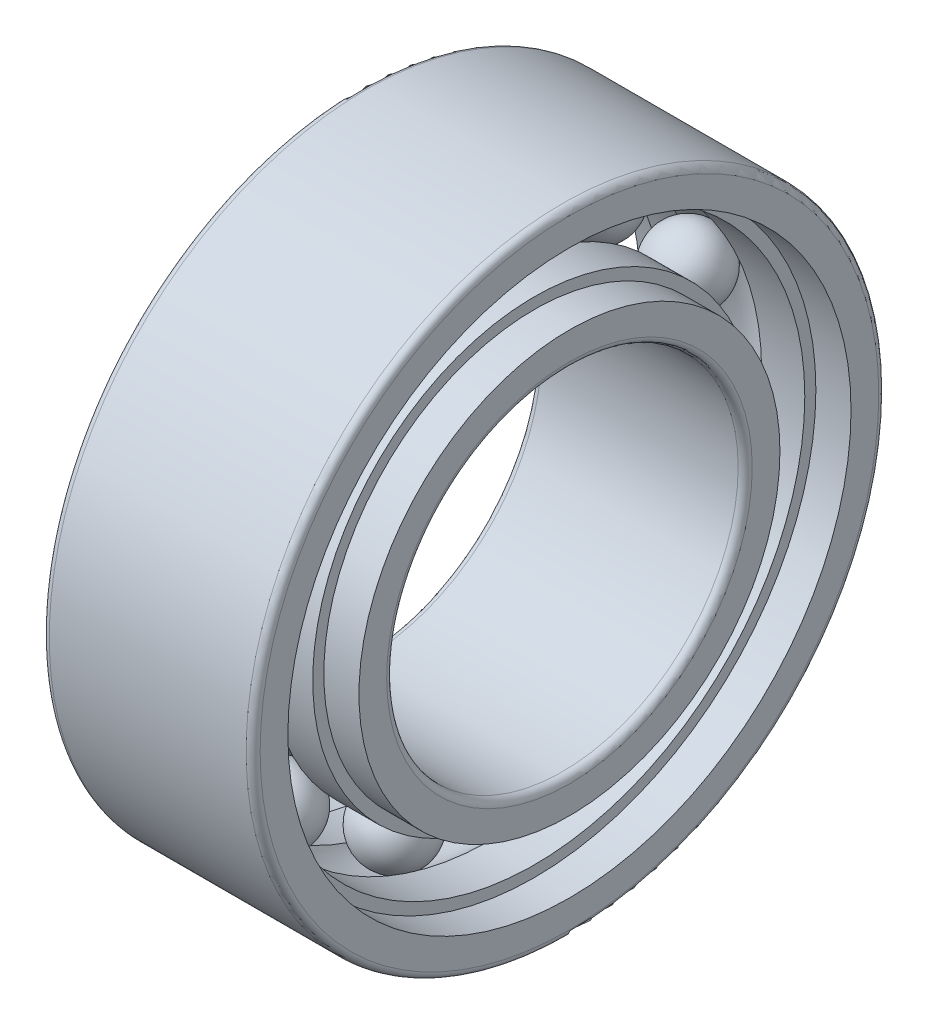
ISO-10303-21;
HEADER;
FILE_DESCRIPTION(('STEP AP214'),'2;1');
FILE_NAME('part.step','',(''),(''),'','','');
FILE_SCHEMA(('AUTOMOTIVE_DESIGN { 1 0 10303 214 1 1 1 1 }'));
ENDSEC;
DATA;
#1=APPLICATION_CONTEXT('core data for automotive mechanical design processes');
#2=APPLICATION_PROTOCOL_DEFINITION('international standard','automotive_design',2000,#1);
#3=PRODUCT_CONTEXT('',#1,'mechanical');
#4=PRODUCT('Part','Part','',(#3));
#5=PRODUCT_RELATED_PRODUCT_CATEGORY('part','',(#4));
#6=PRODUCT_DEFINITION_FORMATION('','',#4);
#7=PRODUCT_DEFINITION_CONTEXT('part definition',#1,'design');
#8=PRODUCT_DEFINITION('design','',#6,#7);
#9=PRODUCT_DEFINITION_SHAPE('','',#8);
#10=(LENGTH_UNIT() NAMED_UNIT(*) SI_UNIT(.MILLI.,.METRE.));
#11=(NAMED_UNIT(*) PLANE_ANGLE_UNIT() SI_UNIT($,.RADIAN.));
#12=(NAMED_UNIT(*) SI_UNIT($,.STERADIAN.) SOLID_ANGLE_UNIT());
#13=UNCERTAINTY_MEASURE_WITH_UNIT(LENGTH_MEASURE(1.E-05),#10,'distance_accuracy_value','');
#14=(GEOMETRIC_REPRESENTATION_CONTEXT(3) GLOBAL_UNCERTAINTY_ASSIGNED_CONTEXT((#13)) GLOBAL_UNIT_ASSIGNED_CONTEXT((#10,
#11,#12)) REPRESENTATION_CONTEXT('',''));
#15=CARTESIAN_POINT('',(0.,0.,0.));
#16=DIRECTION('',(0.,0.,1.));
#17=DIRECTION('',(1.,0.,0.));
#18=AXIS2_PLACEMENT_3D('',#15,#16,#17);
#19=CARTESIAN_POINT('',(1.5,0.,0.));
#20=DIRECTION('',(1.,0.,0.));
#21=DIRECTION('',(0.,0.,-1.));
#22=AXIS2_PLACEMENT_3D('',#19,#20,#21);
#23=TOROIDAL_SURFACE('',#22,3.5,0.52);
#24=CARTESIAN_POINT('',(1.11361159437685,0.,0.));
#25=DIRECTION('',(1.,0.,0.));
#26=DIRECTION('',(0.,0.,-1.));
#27=AXIS2_PLACEMENT_3D('',#24,#25,#26);
#28=CIRCLE('',#27,3.152);
#29=CARTESIAN_POINT('',(1.11361159437685,0.,-3.152));
#30=VERTEX_POINT('',#29);
#31=EDGE_CURVE('P0_E141',#30,#30,#28,.F.);
#32=ORIENTED_EDGE('',*,*,#31,.F.);
#33=EDGE_LOOP('',(#32));
#34=FACE_BOUND('',#33,.T.);
#35=CARTESIAN_POINT('',(1.88638840562315,0.,0.));
#36=DIRECTION('',(1.,0.,0.));
#37=DIRECTION('',(0.,0.,-1.));
#38=AXIS2_PLACEMENT_3D('',#35,#36,#37);
#39=CIRCLE('',#38,3.152);
#40=CARTESIAN_POINT('',(1.88638840562315,0.,-3.152));
#41=VERTEX_POINT('',#40);
#42=EDGE_CURVE('P0_E145',#41,#41,#39,.T.);
#43=ORIENTED_EDGE('',*,*,#42,.F.);
#44=EDGE_LOOP('',(#43));
#45=FACE_BOUND('',#44,.T.);
#46=ADVANCED_FACE('P0_F14',(#34,#45),#23,.F.);
#47=CARTESIAN_POINT('',(2.19319420281158,0.,0.));
#48=DIRECTION('',(1.,0.,0.));
#49=DIRECTION('',(0.,0.,-1.));
#50=AXIS2_PLACEMENT_3D('',#47,#48,#49);
#51=CYLINDRICAL_SURFACE('',#50,3.152);
#52=ORIENTED_EDGE('',*,*,#42,.T.);
#53=EDGE_LOOP('',(#52));
#54=FACE_BOUND('',#53,.T.);
#55=CARTESIAN_POINT('',(2.50000000000001,0.,0.));
#56=DIRECTION('',(1.,0.,0.));
#57=DIRECTION('',(0.,0.,-1.));
#58=AXIS2_PLACEMENT_3D('',#55,#56,#57);
#59=CIRCLE('',#58,3.152);
#60=CARTESIAN_POINT('',(2.50000000000001,0.,-3.152));
#61=VERTEX_POINT('',#60);
#62=EDGE_CURVE('P0_E18',#61,#61,#59,.T.);
#63=ORIENTED_EDGE('',*,*,#62,.F.);
#64=EDGE_LOOP('',(#63));
#65=FACE_BOUND('',#64,.T.);
#66=ADVANCED_FACE('P0_F100',(#54,#65),#51,.T.);
#67=CARTESIAN_POINT('',(0.806805797188427,0.,0.));
#68=DIRECTION('',(1.,0.,0.));
#69=DIRECTION('',(0.,0.,-1.));
#70=AXIS2_PLACEMENT_3D('',#67,#68,#69);
#71=CYLINDRICAL_SURFACE('',#70,3.152);
#72=CARTESIAN_POINT('',(0.500000000000003,0.,0.));
#73=DIRECTION('',(1.,0.,0.));
#74=DIRECTION('',(0.,0.,-1.));
#75=AXIS2_PLACEMENT_3D('',#72,#73,#74);
#76=CIRCLE('',#75,3.152);
#77=CARTESIAN_POINT('',(0.500000000000003,0.,-3.152));
#78=VERTEX_POINT('',#77);
#79=EDGE_CURVE('P0_E136',#78,#78,#76,.F.);
#80=ORIENTED_EDGE('',*,*,#79,.F.);
#81=EDGE_LOOP('',(#80));
#82=FACE_BOUND('',#81,.T.);
#83=ORIENTED_EDGE('',*,*,#31,.T.);
#84=EDGE_LOOP('',(#83));
#85=FACE_BOUND('',#84,.T.);
#86=ADVANCED_FACE('P0_F97',(#82,#85),#71,.T.);
#87=CARTESIAN_POINT('',(2.50000000000001,3.0732,0.));
#88=DIRECTION('',(1.,0.,0.));
#89=DIRECTION('',(0.,0.,-1.));
#90=AXIS2_PLACEMENT_3D('',#87,#88,#89);
#91=PLANE('',#90);
#92=CARTESIAN_POINT('',(2.50000000000001,0.,0.));
#93=DIRECTION('',(1.,0.,0.));
#94=DIRECTION('',(0.,0.,-1.));
#95=AXIS2_PLACEMENT_3D('',#92,#93,#94);
#96=CIRCLE('',#95,2.9944);
#97=CARTESIAN_POINT('',(2.50000000000001,0.,-2.9944));
#98=VERTEX_POINT('',#97);
#99=EDGE_CURVE('P0_E134',#98,#98,#96,.T.);
#100=ORIENTED_EDGE('',*,*,#99,.F.);
#101=EDGE_LOOP('',(#100));
#102=FACE_BOUND('',#101,.T.);
#103=ORIENTED_EDGE('',*,*,#62,.T.);
#104=EDGE_LOOP('',(#103));
#105=FACE_BOUND('',#104,.T.);
#106=ADVANCED_FACE('P0_F93',(#102,#105),#91,.T.);
#107=CARTESIAN_POINT('',(0.500000000000003,3.0732,0.));
#108=DIRECTION('',(-1.,0.,0.));
#109=DIRECTION('',(0.,0.,1.));
#110=AXIS2_PLACEMENT_3D('',#107,#108,#109);
#111=PLANE('',#110);
#112=CARTESIAN_POINT('',(0.500000000000003,0.,0.));
#113=DIRECTION('',(1.,0.,0.));
#114=DIRECTION('',(0.,0.,-1.));
#115=AXIS2_PLACEMENT_3D('',#112,#113,#114);
#116=CIRCLE('',#115,2.9944);
#117=CARTESIAN_POINT('',(0.500000000000003,0.,-2.9944));
#118=VERTEX_POINT('',#117);
#119=EDGE_CURVE('P0_E127',#118,#118,#116,.F.);
#120=ORIENTED_EDGE('',*,*,#119,.F.);
#121=EDGE_LOOP('',(#120));
#122=FACE_BOUND('',#121,.T.);
#123=ORIENTED_EDGE('',*,*,#79,.T.);
#124=EDGE_LOOP('',(#123));
#125=FACE_BOUND('',#124,.T.);
#126=ADVANCED_FACE('P0_F89',(#122,#125),#111,.T.);
#127=CARTESIAN_POINT('',(2.75000000000001,0.,0.));
#128=DIRECTION('',(1.,0.,0.));
#129=DIRECTION('',(0.,0.,-1.));
#130=AXIS2_PLACEMENT_3D('',#127,#128,#129);
#131=CYLINDRICAL_SURFACE('',#130,2.9944);
#132=ORIENTED_EDGE('',*,*,#99,.T.);
#133=EDGE_LOOP('',(#132));
#134=FACE_BOUND('',#133,.T.);
#135=CARTESIAN_POINT('',(3.00000000000001,0.,0.));
#136=DIRECTION('',(1.,0.,0.));
#137=DIRECTION('',(0.,0.,-1.));
#138=AXIS2_PLACEMENT_3D('',#135,#136,#137);
#139=CIRCLE('',#138,2.9944);
#140=CARTESIAN_POINT('',(3.00000000000001,0.,-2.9944));
#141=VERTEX_POINT('',#140);
#142=EDGE_CURVE('P0_E122',#141,#141,#139,.T.);
#143=ORIENTED_EDGE('',*,*,#142,.F.);
#144=EDGE_LOOP('',(#143));
#145=FACE_BOUND('',#144,.T.);
#146=ADVANCED_FACE('P0_F85',(#134,#145),#131,.T.);
#147=CARTESIAN_POINT('',(0.250000000000001,0.,0.));
#148=DIRECTION('',(1.,0.,0.));
#149=DIRECTION('',(0.,0.,-1.));
#150=AXIS2_PLACEMENT_3D('',#147,#148,#149);
#151=CYLINDRICAL_SURFACE('',#150,2.9944);
#152=CARTESIAN_POINT('',(0.,0.,0.));
#153=DIRECTION('',(1.,0.,0.));
#154=DIRECTION('',(0.,0.,-1.));
#155=AXIS2_PLACEMENT_3D('',#152,#153,#154);
#156=CIRCLE('',#155,2.9944);
#157=CARTESIAN_POINT('',(0.,0.,-2.9944));
#158=VERTEX_POINT('',#157);
#159=EDGE_CURVE('P0_E120',#158,#158,#156,.F.);
#160=ORIENTED_EDGE('',*,*,#159,.F.);
#161=EDGE_LOOP('',(#160));
#162=FACE_BOUND('',#161,.T.);
#163=ORIENTED_EDGE('',*,*,#119,.T.);
#164=EDGE_LOOP('',(#163));
#165=FACE_BOUND('',#164,.T.);
#166=ADVANCED_FACE('P0_F81',(#162,#165),#151,.T.);
#167=CARTESIAN_POINT('',(3.00000000000001,2.7472,0.));
#168=DIRECTION('',(1.,0.,0.));
#169=DIRECTION('',(0.,0.,-1.));
#170=AXIS2_PLACEMENT_3D('',#167,#168,#169);
#171=PLANE('',#170);
#172=CARTESIAN_POINT('',(3.00000000000001,0.,0.));
#173=DIRECTION('',(1.,0.,0.));
#174=DIRECTION('',(0.,1.,0.));
#175=AXIS2_PLACEMENT_3D('',#172,#173,#174);
#176=CIRCLE('',#175,2.6);
#177=CARTESIAN_POINT('',(3.00000000000001,2.6,0.));
#178=VERTEX_POINT('',#177);
#179=EDGE_CURVE('P0_E65',#178,#178,#176,.T.);
#180=ORIENTED_EDGE('',*,*,#179,.F.);
#181=EDGE_LOOP('',(#180));
#182=FACE_BOUND('',#181,.T.);
#183=ORIENTED_EDGE('',*,*,#142,.T.);
#184=EDGE_LOOP('',(#183));
#185=FACE_BOUND('',#184,.T.);
#186=ADVANCED_FACE('P0_F71',(#182,#185),#171,.T.);
#187=CARTESIAN_POINT('',(0.,2.7472,0.));
#188=DIRECTION('',(-1.,0.,0.));
#189=DIRECTION('',(0.,0.,1.));
#190=AXIS2_PLACEMENT_3D('',#187,#188,#189);
#191=PLANE('',#190);
#192=CARTESIAN_POINT('',(0.,0.,0.));
#193=DIRECTION('',(-1.,0.,0.));
#194=DIRECTION('',(0.,1.,0.));
#195=AXIS2_PLACEMENT_3D('',#192,#193,#194);
#196=CIRCLE('',#195,2.6);
#197=CARTESIAN_POINT('',(0.,2.6,0.));
#198=VERTEX_POINT('',#197);
#199=EDGE_CURVE('P0_E27',#198,#198,#196,.T.);
#200=ORIENTED_EDGE('',*,*,#199,.F.);
#201=EDGE_LOOP('',(#200));
#202=FACE_BOUND('',#201,.T.);
#203=ORIENTED_EDGE('',*,*,#159,.T.);
#204=EDGE_LOOP('',(#203));
#205=FACE_BOUND('',#204,.T.);
#206=ADVANCED_FACE('P0_F80',(#202,#205),#191,.T.);
#207=CARTESIAN_POINT('',(2.90000000000001,0.,0.));
#208=DIRECTION('',(1.,0.,0.));
#209=DIRECTION('',(0.,0.,-1.));
#210=AXIS2_PLACEMENT_3D('',#207,#208,#209);
#211=TOROIDAL_SURFACE('',#210,2.6,0.1);
#212=CARTESIAN_POINT('',(2.90000000000001,0.,0.));
#213=DIRECTION('',(1.,0.,0.));
#214=DIRECTION('',(0.,0.,-1.));
#215=AXIS2_PLACEMENT_3D('',#212,#213,#214);
#216=CIRCLE('',#215,2.5);
#217=CARTESIAN_POINT('',(2.90000000000001,0.,-2.5));
#218=VERTEX_POINT('',#217);
#219=EDGE_CURVE('P0_E22',#218,#218,#216,.F.);
#220=ORIENTED_EDGE('',*,*,#219,.T.);
#221=EDGE_LOOP('',(#220));
#222=FACE_BOUND('',#221,.T.);
#223=ORIENTED_EDGE('',*,*,#179,.T.);
#224=EDGE_LOOP('',(#223));
#225=FACE_BOUND('',#224,.T.);
#226=ADVANCED_FACE('P0_F45',(#222,#225),#211,.T.);
#227=CARTESIAN_POINT('',(0.1,0.,0.));
#228=DIRECTION('',(1.,0.,0.));
#229=DIRECTION('',(0.,0.,-1.));
#230=AXIS2_PLACEMENT_3D('',#227,#228,#229);
#231=TOROIDAL_SURFACE('',#230,2.6,0.1);
#232=ORIENTED_EDGE('',*,*,#199,.T.);
#233=EDGE_LOOP('',(#232));
#234=FACE_BOUND('',#233,.T.);
#235=CARTESIAN_POINT('',(0.1,0.,0.));
#236=DIRECTION('',(1.,0.,0.));
#237=DIRECTION('',(0.,0.,-1.));
#238=AXIS2_PLACEMENT_3D('',#235,#236,#237);
#239=CIRCLE('',#238,2.5);
#240=CARTESIAN_POINT('',(0.1,0.,-2.5));
#241=VERTEX_POINT('',#240);
#242=EDGE_CURVE('P0_E10',#241,#241,#239,.T.);
#243=ORIENTED_EDGE('',*,*,#242,.T.);
#244=EDGE_LOOP('',(#243));
#245=FACE_BOUND('',#244,.T.);
#246=ADVANCED_FACE('P0_F39',(#234,#245),#231,.T.);
#247=CARTESIAN_POINT('',(1.5,0.,0.));
#248=DIRECTION('',(1.,0.,0.));
#249=DIRECTION('',(0.,0.,-1.));
#250=AXIS2_PLACEMENT_3D('',#247,#248,#249);
#251=CYLINDRICAL_SURFACE('',#250,2.5);
#252=ORIENTED_EDGE('',*,*,#242,.F.);
#253=EDGE_LOOP('',(#252));
#254=FACE_BOUND('',#253,.T.);
#255=ORIENTED_EDGE('',*,*,#219,.F.);
#256=EDGE_LOOP('',(#255));
#257=FACE_BOUND('',#256,.T.);
#258=ADVANCED_FACE('P0_F44',(#254,#257),#251,.F.);
#259=CLOSED_SHELL('',(#46,#66,#86,#106,#126,#146,#166,#186,#206,#226,#246,#258));
#260=MANIFOLD_SOLID_BREP('P0_B1',#259);
#261=CARTESIAN_POINT('',(1.5,-3.35822540765074,-0.986063948945003));
#262=DIRECTION('',(1.,0.,0.));
#263=DIRECTION('',(0.,-0.959492973614497,-0.28173255684143));
#264=AXIS2_PLACEMENT_3D('',#261,#262,#263);
#265=SPHERICAL_SURFACE('',#264,0.52);
#266=CARTESIAN_POINT('',(0.98,-3.35822540765074,-0.986063948945003));
#267=VERTEX_POINT('',#266);
#268=VERTEX_LOOP('',#267);
#269=FACE_BOUND('',#268,.T.);
#270=CARTESIAN_POINT('',(2.02,-3.35822540765074,-0.986063948945003));
#271=VERTEX_POINT('',#270);
#272=VERTEX_LOOP('',#271);
#273=FACE_BOUND('',#272,.T.);
#274=ADVANCED_FACE('P1_F15',(#269,#273),#265,.T.);
#275=CLOSED_SHELL('',(#274));
#276=MANIFOLD_SOLID_BREP('P1_B1',#275);
#277=CARTESIAN_POINT('',(1.5,-2.2920125688085,-2.6451235102399));
#278=DIRECTION('',(1.,0.,0.));
#279=DIRECTION('',(0.,-0.654860733945285,-0.755749574354258));
#280=AXIS2_PLACEMENT_3D('',#277,#278,#279);
#281=SPHERICAL_SURFACE('',#280,0.52);
#282=CARTESIAN_POINT('',(0.98,-2.2920125688085,-2.6451235102399));
#283=VERTEX_POINT('',#282);
#284=VERTEX_LOOP('',#283);
#285=FACE_BOUND('',#284,.T.);
#286=CARTESIAN_POINT('',(2.02,-2.2920125688085,-2.6451235102399));
#287=VERTEX_POINT('',#286);
#288=VERTEX_LOOP('',#287);
#289=FACE_BOUND('',#288,.T.);
#290=ADVANCED_FACE('P2_F15',(#285,#289),#281,.T.);
#291=CLOSED_SHELL('',(#290));
#292=MANIFOLD_SOLID_BREP('P2_B1',#291);
#293=CARTESIAN_POINT('',(1.5,3.5,0.));
#294=DIRECTION('',(1.,0.,0.));
#295=DIRECTION('',(0.,1.,0.));
#296=AXIS2_PLACEMENT_3D('',#293,#294,#295);
#297=SPHERICAL_SURFACE('',#296,0.52);
#298=CARTESIAN_POINT('',(0.98,3.5,0.));
#299=VERTEX_POINT('',#298);
#300=VERTEX_LOOP('',#299);
#301=FACE_BOUND('',#300,.T.);
#302=CARTESIAN_POINT('',(2.02,3.5,0.));
#303=VERTEX_POINT('',#302);
#304=VERTEX_LOOP('',#303);
#305=FACE_BOUND('',#304,.T.);
#306=ADVANCED_FACE('P3_F15',(#301,#305),#297,.T.);
#307=CLOSED_SHELL('',(#306));
#308=MANIFOLD_SOLID_BREP('P3_B1',#307);
#309=CARTESIAN_POINT('',(1.5,0.,0.));
#310=DIRECTION('',(1.,0.,0.));
#311=DIRECTION('',(0.,0.,-1.));
#312=AXIS2_PLACEMENT_3D('',#309,#310,#311);
#313=TOROIDAL_SURFACE('',#312,3.5,0.52);
#314=CARTESIAN_POINT('',(1.11361159437685,0.,0.));
#315=DIRECTION('',(1.,0.,0.));
#316=DIRECTION('',(0.,0.,-1.));
#317=AXIS2_PLACEMENT_3D('',#314,#315,#316);
#318=CIRCLE('',#317,3.848);
#319=CARTESIAN_POINT('',(1.11361159437685,0.,-3.848));
#320=VERTEX_POINT('',#319);
#321=EDGE_CURVE('P4_E143',#320,#320,#318,.F.);
#322=ORIENTED_EDGE('',*,*,#321,.T.);
#323=EDGE_LOOP('',(#322));
#324=FACE_BOUND('',#323,.T.);
#325=CARTESIAN_POINT('',(1.88638840562315,0.,0.));
#326=DIRECTION('',(1.,0.,0.));
#327=DIRECTION('',(0.,0.,-1.));
#328=AXIS2_PLACEMENT_3D('',#325,#326,#327);
#329=CIRCLE('',#328,3.84800000000001);
#330=CARTESIAN_POINT('',(1.88638840562315,0.,-3.84800000000001));
#331=VERTEX_POINT('',#330);
#332=EDGE_CURVE('P4_E140',#331,#331,#329,.T.);
#333=ORIENTED_EDGE('',*,*,#332,.T.);
#334=EDGE_LOOP('',(#333));
#335=FACE_BOUND('',#334,.T.);
#336=ADVANCED_FACE('P4_F14',(#324,#335),#313,.F.);
#337=CARTESIAN_POINT('',(0.806805797188427,0.,0.));
#338=DIRECTION('',(1.,0.,0.));
#339=DIRECTION('',(0.,0.,-1.));
#340=AXIS2_PLACEMENT_3D('',#337,#338,#339);
#341=CYLINDRICAL_SURFACE('',#340,3.848);
#342=ORIENTED_EDGE('',*,*,#321,.F.);
#343=EDGE_LOOP('',(#342));
#344=FACE_BOUND('',#343,.T.);
#345=CARTESIAN_POINT('',(0.500000000000002,0.,0.));
#346=DIRECTION('',(1.,0.,0.));
#347=DIRECTION('',(0.,0.,-1.));
#348=AXIS2_PLACEMENT_3D('',#345,#346,#347);
#349=CIRCLE('',#348,3.848);
#350=CARTESIAN_POINT('',(0.500000000000002,0.,-3.848));
#351=VERTEX_POINT('',#350);
#352=EDGE_CURVE('P4_E18',#351,#351,#349,.T.);
#353=ORIENTED_EDGE('',*,*,#352,.F.);
#354=EDGE_LOOP('',(#353));
#355=FACE_BOUND('',#354,.T.);
#356=ADVANCED_FACE('P4_F101',(#344,#355),#341,.F.);
#357=CARTESIAN_POINT('',(2.19319420281158,0.,0.));
#358=DIRECTION('',(1.,0.,0.));
#359=DIRECTION('',(0.,0.,-1.));
#360=AXIS2_PLACEMENT_3D('',#357,#358,#359);
#361=CYLINDRICAL_SURFACE('',#360,3.84800000000001);
#362=CARTESIAN_POINT('',(2.50000000000001,0.,0.));
#363=DIRECTION('',(1.,0.,0.));
#364=DIRECTION('',(0.,0.,-1.));
#365=AXIS2_PLACEMENT_3D('',#362,#363,#364);
#366=CIRCLE('',#365,3.84800000000001);
#367=CARTESIAN_POINT('',(2.50000000000001,0.,-3.84800000000001));
#368=VERTEX_POINT('',#367);
#369=EDGE_CURVE('P4_E136',#368,#368,#366,.F.);
#370=ORIENTED_EDGE('',*,*,#369,.F.);
#371=EDGE_LOOP('',(#370));
#372=FACE_BOUND('',#371,.T.);
#373=ORIENTED_EDGE('',*,*,#332,.F.);
#374=EDGE_LOOP('',(#373));
#375=FACE_BOUND('',#374,.T.);
#376=ADVANCED_FACE('P4_F98',(#372,#375),#361,.F.);
#377=CARTESIAN_POINT('',(0.500000000000002,3.9268,0.));
#378=DIRECTION('',(-1.,0.,0.));
#379=DIRECTION('',(0.,0.,1.));
#380=AXIS2_PLACEMENT_3D('',#377,#378,#379);
#381=PLANE('',#380);
#382=ORIENTED_EDGE('',*,*,#352,.T.);
#383=EDGE_LOOP('',(#382));
#384=FACE_BOUND('',#383,.T.);
#385=CARTESIAN_POINT('',(0.500000000000002,0.,0.));
#386=DIRECTION('',(1.,0.,0.));
#387=DIRECTION('',(0.,0.,-1.));
#388=AXIS2_PLACEMENT_3D('',#385,#386,#387);
#389=CIRCLE('',#388,4.0056);
#390=CARTESIAN_POINT('',(0.500000000000002,0.,-4.0056));
#391=VERTEX_POINT('',#390);
#392=EDGE_CURVE('P4_E134',#391,#391,#389,.F.);
#393=ORIENTED_EDGE('',*,*,#392,.T.);
#394=EDGE_LOOP('',(#393));
#395=FACE_BOUND('',#394,.T.);
#396=ADVANCED_FACE('P4_F94',(#384,#395),#381,.T.);
#397=CARTESIAN_POINT('',(2.50000000000001,3.9268,0.));
#398=DIRECTION('',(1.,0.,0.));
#399=DIRECTION('',(0.,0.,-1.));
#400=AXIS2_PLACEMENT_3D('',#397,#398,#399);
#401=PLANE('',#400);
#402=ORIENTED_EDGE('',*,*,#369,.T.);
#403=EDGE_LOOP('',(#402));
#404=FACE_BOUND('',#403,.T.);
#405=CARTESIAN_POINT('',(2.50000000000001,0.,0.));
#406=DIRECTION('',(1.,0.,0.));
#407=DIRECTION('',(0.,0.,-1.));
#408=AXIS2_PLACEMENT_3D('',#405,#406,#407);
#409=CIRCLE('',#408,4.0056);
#410=CARTESIAN_POINT('',(2.50000000000001,0.,-4.0056));
#411=VERTEX_POINT('',#410);
#412=EDGE_CURVE('P4_E127',#411,#411,#409,.T.);
#413=ORIENTED_EDGE('',*,*,#412,.T.);
#414=EDGE_LOOP('',(#413));
#415=FACE_BOUND('',#414,.T.);
#416=ADVANCED_FACE('P4_F90',(#404,#415),#401,.T.);
#417=CARTESIAN_POINT('',(0.250000000000001,0.,0.));
#418=DIRECTION('',(1.,0.,0.));
#419=DIRECTION('',(0.,0.,-1.));
#420=AXIS2_PLACEMENT_3D('',#417,#418,#419);
#421=CYLINDRICAL_SURFACE('',#420,4.0056);
#422=ORIENTED_EDGE('',*,*,#392,.F.);
#423=EDGE_LOOP('',(#422));
#424=FACE_BOUND('',#423,.T.);
#425=CARTESIAN_POINT('',(0.,0.,0.));
#426=DIRECTION('',(1.,0.,0.));
#427=DIRECTION('',(0.,0.,-1.));
#428=AXIS2_PLACEMENT_3D('',#425,#426,#427);
#429=CIRCLE('',#428,4.0056);
#430=CARTESIAN_POINT('',(0.,0.,-4.0056));
#431=VERTEX_POINT('',#430);
#432=EDGE_CURVE('P4_E122',#431,#431,#429,.T.);
#433=ORIENTED_EDGE('',*,*,#432,.F.);
#434=EDGE_LOOP('',(#433));
#435=FACE_BOUND('',#434,.T.);
#436=ADVANCED_FACE('P4_F86',(#424,#435),#421,.F.);
#437=CARTESIAN_POINT('',(2.75000000000001,0.,0.));
#438=DIRECTION('',(1.,0.,0.));
#439=DIRECTION('',(0.,0.,-1.));
#440=AXIS2_PLACEMENT_3D('',#437,#438,#439);
#441=CYLINDRICAL_SURFACE('',#440,4.0056);
#442=CARTESIAN_POINT('',(3.00000000000001,0.,0.));
#443=DIRECTION('',(1.,0.,0.));
#444=DIRECTION('',(0.,0.,-1.));
#445=AXIS2_PLACEMENT_3D('',#442,#443,#444);
#446=CIRCLE('',#445,4.0056);
#447=CARTESIAN_POINT('',(3.00000000000001,0.,-4.0056));
#448=VERTEX_POINT('',#447);
#449=EDGE_CURVE('P4_E120',#448,#448,#446,.F.);
#450=ORIENTED_EDGE('',*,*,#449,.F.);
#451=EDGE_LOOP('',(#450));
#452=FACE_BOUND('',#451,.T.);
#453=ORIENTED_EDGE('',*,*,#412,.F.);
#454=EDGE_LOOP('',(#453));
#455=FACE_BOUND('',#454,.T.);
#456=ADVANCED_FACE('P4_F81',(#452,#455),#441,.F.);
#457=CARTESIAN_POINT('',(0.,4.2528,0.));
#458=DIRECTION('',(-1.,0.,0.));
#459=DIRECTION('',(0.,0.,1.));
#460=AXIS2_PLACEMENT_3D('',#457,#458,#459);
#461=PLANE('',#460);
#462=ORIENTED_EDGE('',*,*,#432,.T.);
#463=EDGE_LOOP('',(#462));
#464=FACE_BOUND('',#463,.T.);
#465=CARTESIAN_POINT('',(0.,0.,0.));
#466=DIRECTION('',(1.,0.,0.));
#467=DIRECTION('',(0.,1.,0.));
#468=AXIS2_PLACEMENT_3D('',#465,#466,#467);
#469=CIRCLE('',#468,4.4);
#470=CARTESIAN_POINT('',(0.,4.4,0.));
#471=VERTEX_POINT('',#470);
#472=EDGE_CURVE('P4_E65',#471,#471,#469,.T.);
#473=ORIENTED_EDGE('',*,*,#472,.F.);
#474=EDGE_LOOP('',(#473));
#475=FACE_BOUND('',#474,.T.);
#476=ADVANCED_FACE('P4_F71',(#464,#475),#461,.T.);
#477=CARTESIAN_POINT('',(3.00000000000001,4.2528,0.));
#478=DIRECTION('',(1.,0.,0.));
#479=DIRECTION('',(0.,0.,-1.));
#480=AXIS2_PLACEMENT_3D('',#477,#478,#479);
#481=PLANE('',#480);
#482=ORIENTED_EDGE('',*,*,#449,.T.);
#483=EDGE_LOOP('',(#482));
#484=FACE_BOUND('',#483,.T.);
#485=CARTESIAN_POINT('',(3.00000000000001,0.,0.));
#486=DIRECTION('',(-1.,0.,0.));
#487=DIRECTION('',(0.,1.,0.));
#488=AXIS2_PLACEMENT_3D('',#485,#486,#487);
#489=CIRCLE('',#488,4.4);
#490=CARTESIAN_POINT('',(3.00000000000001,4.4,0.));
#491=VERTEX_POINT('',#490);
#492=EDGE_CURVE('P4_E27',#491,#491,#489,.T.);
#493=ORIENTED_EDGE('',*,*,#492,.F.);
#494=EDGE_LOOP('',(#493));
#495=FACE_BOUND('',#494,.T.);
#496=ADVANCED_FACE('P4_F80',(#484,#495),#481,.T.);
#497=CARTESIAN_POINT('',(0.0999999999999998,0.,0.));
#498=DIRECTION('',(1.,0.,0.));
#499=DIRECTION('',(0.,0.,-1.));
#500=AXIS2_PLACEMENT_3D('',#497,#498,#499);
#501=TOROIDAL_SURFACE('',#500,4.4,0.1);
#502=CARTESIAN_POINT('',(0.0999999999999998,0.,0.));
#503=DIRECTION('',(1.,0.,0.));
#504=DIRECTION('',(0.,0.,-1.));
#505=AXIS2_PLACEMENT_3D('',#502,#503,#504);
#506=CIRCLE('',#505,4.5);
#507=CARTESIAN_POINT('',(0.0999999999999998,0.,-4.5));
#508=VERTEX_POINT('',#507);
#509=EDGE_CURVE('P4_E22',#508,#508,#506,.T.);
#510=ORIENTED_EDGE('',*,*,#509,.F.);
#511=EDGE_LOOP('',(#510));
#512=FACE_BOUND('',#511,.T.);
#513=ORIENTED_EDGE('',*,*,#472,.T.);
#514=EDGE_LOOP('',(#513));
#515=FACE_BOUND('',#514,.T.);
#516=ADVANCED_FACE('P4_F45',(#512,#515),#501,.T.);
#517=CARTESIAN_POINT('',(2.90000000000001,0.,0.));
#518=DIRECTION('',(1.,0.,0.));
#519=DIRECTION('',(0.,0.,-1.));
#520=AXIS2_PLACEMENT_3D('',#517,#518,#519);
#521=TOROIDAL_SURFACE('',#520,4.4,0.1);
#522=ORIENTED_EDGE('',*,*,#492,.T.);
#523=EDGE_LOOP('',(#522));
#524=FACE_BOUND('',#523,.T.);
#525=CARTESIAN_POINT('',(2.90000000000001,0.,0.));
#526=DIRECTION('',(1.,0.,0.));
#527=DIRECTION('',(0.,0.,-1.));
#528=AXIS2_PLACEMENT_3D('',#525,#526,#527);
#529=CIRCLE('',#528,4.5);
#530=CARTESIAN_POINT('',(2.90000000000001,0.,-4.5));
#531=VERTEX_POINT('',#530);
#532=EDGE_CURVE('P4_E10',#531,#531,#529,.F.);
#533=ORIENTED_EDGE('',*,*,#532,.F.);
#534=EDGE_LOOP('',(#533));
#535=FACE_BOUND('',#534,.T.);
#536=ADVANCED_FACE('P4_F39',(#524,#535),#521,.T.);
#537=CARTESIAN_POINT('',(2.00000000000001,0.,0.));
#538=DIRECTION('',(1.,0.,0.));
#539=DIRECTION('',(0.,0.,-1.));
#540=AXIS2_PLACEMENT_3D('',#537,#538,#539);
#541=CYLINDRICAL_SURFACE('',#540,4.5);
#542=ORIENTED_EDGE('',*,*,#532,.T.);
#543=EDGE_LOOP('',(#542));
#544=FACE_BOUND('',#543,.T.);
#545=ORIENTED_EDGE('',*,*,#509,.T.);
#546=EDGE_LOOP('',(#545));
#547=FACE_BOUND('',#546,.T.);
#548=ADVANCED_FACE('P4_F44',(#544,#547),#541,.T.);
#549=CLOSED_SHELL('',(#336,#356,#376,#396,#416,#436,#456,#476,#496,#516,#536,#548));
#550=MANIFOLD_SOLID_BREP('P4_B1',#549);
#551=CARTESIAN_POINT('',(1.5,1.4539525455066,-3.18371198374082));
#552=DIRECTION('',(1.,0.,0.));
#553=DIRECTION('',(0.,0.415415013001886,-0.909631995354519));
#554=AXIS2_PLACEMENT_3D('',#551,#552,#553);
#555=SPHERICAL_SURFACE('',#554,0.52);
#556=CARTESIAN_POINT('',(0.98,1.4539525455066,-3.18371198374082));
#557=VERTEX_POINT('',#556);
#558=VERTEX_LOOP('',#557);
#559=FACE_BOUND('',#558,.T.);
#560=CARTESIAN_POINT('',(2.02,1.4539525455066,-3.18371198374082));
#561=VERTEX_POINT('',#560);
#562=VERTEX_LOOP('',#561);
#563=FACE_BOUND('',#562,.T.);
#564=ADVANCED_FACE('P5_F15',(#559,#563),#555,.T.);
#565=CLOSED_SHELL('',(#564));
#566=MANIFOLD_SOLID_BREP('P5_B1',#565);
#567=CARTESIAN_POINT('',(1.5,2.94438736490914,1.89224286109459));
#568=DIRECTION('',(1.,0.,0.));
#569=DIRECTION('',(0.,0.841253532831181,0.540640817455598));
#570=AXIS2_PLACEMENT_3D('',#567,#568,#569);
#571=SPHERICAL_SURFACE('',#570,0.52);
#572=CARTESIAN_POINT('',(0.98,2.94438736490914,1.89224286109459));
#573=VERTEX_POINT('',#572);
#574=VERTEX_LOOP('',#573);
#575=FACE_BOUND('',#574,.T.);
#576=CARTESIAN_POINT('',(2.02,2.94438736490914,1.89224286109459));
#577=VERTEX_POINT('',#576);
#578=VERTEX_LOOP('',#577);
#579=FACE_BOUND('',#578,.T.);
#580=ADVANCED_FACE('P6_F15',(#575,#579),#571,.T.);
#581=CLOSED_SHELL('',(#580));
#582=MANIFOLD_SOLID_BREP('P6_B1',#581);
#583=CARTESIAN_POINT('',(1.5,-2.2920125688085,2.64512351023991));
#584=DIRECTION('',(1.,0.,0.));
#585=DIRECTION('',(0.,-0.654860733945285,0.755749574354259));
#586=AXIS2_PLACEMENT_3D('',#583,#584,#585);
#587=SPHERICAL_SURFACE('',#586,0.52);
#588=CARTESIAN_POINT('',(0.98,-2.2920125688085,2.64512351023991));
#589=VERTEX_POINT('',#588);
#590=VERTEX_LOOP('',#589);
#591=FACE_BOUND('',#590,.T.);
#592=CARTESIAN_POINT('',(2.02,-2.2920125688085,2.64512351023991));
#593=VERTEX_POINT('',#592);
#594=VERTEX_LOOP('',#593);
#595=FACE_BOUND('',#594,.T.);
#596=ADVANCED_FACE('P7_F15',(#591,#595),#587,.T.);
#597=CLOSED_SHELL('',(#596));
#598=MANIFOLD_SOLID_BREP('P7_B1',#597);
#599=CARTESIAN_POINT('',(1.5,2.94438736490914,-1.89224286109459));
#600=DIRECTION('',(1.,0.,0.));
#601=DIRECTION('',(0.,0.841253532831181,-0.540640817455598));
#602=AXIS2_PLACEMENT_3D('',#599,#600,#601);
#603=SPHERICAL_SURFACE('',#602,0.52);
#604=CARTESIAN_POINT('',(0.98,2.94438736490914,-1.89224286109459));
#605=VERTEX_POINT('',#604);
#606=VERTEX_LOOP('',#605);
#607=FACE_BOUND('',#606,.T.);
#608=CARTESIAN_POINT('',(2.02,2.94438736490914,-1.89224286109459));
#609=VERTEX_POINT('',#608);
#610=VERTEX_LOOP('',#609);
#611=FACE_BOUND('',#610,.T.);
#612=ADVANCED_FACE('P8_F15',(#607,#611),#603,.T.);
#613=CLOSED_SHELL('',(#612));
#614=MANIFOLD_SOLID_BREP('P8_B1',#613);
#615=CARTESIAN_POINT('',(1.5,-3.35822540765074,0.986063948945004));
#616=DIRECTION('',(1.,0.,0.));
#617=DIRECTION('',(0.,-0.959492973614497,0.28173255684143));
#618=AXIS2_PLACEMENT_3D('',#615,#616,#617);
#619=SPHERICAL_SURFACE('',#618,0.52);
#620=CARTESIAN_POINT('',(0.98,-3.35822540765074,0.986063948945004));
#621=VERTEX_POINT('',#620);
#622=VERTEX_LOOP('',#621);
#623=FACE_BOUND('',#622,.T.);
#624=CARTESIAN_POINT('',(2.02,-3.35822540765074,0.986063948945004));
#625=VERTEX_POINT('',#624);
#626=VERTEX_LOOP('',#625);
#627=FACE_BOUND('',#626,.T.);
#628=ADVANCED_FACE('P9_F15',(#623,#627),#619,.T.);
#629=CLOSED_SHELL('',(#628));
#630=MANIFOLD_SOLID_BREP('P9_B1',#629);
#631=CARTESIAN_POINT('',(1.5,-0.498101933956498,3.46437504658327));
#632=DIRECTION('',(1.,0.,0.));
#633=DIRECTION('',(0.,-0.142314838273285,0.989821441880933));
#634=AXIS2_PLACEMENT_3D('',#631,#632,#633);
#635=SPHERICAL_SURFACE('',#634,0.52);
#636=CARTESIAN_POINT('',(0.98,-0.498101933956498,3.46437504658327));
#637=VERTEX_POINT('',#636);
#638=VERTEX_LOOP('',#637);
#639=FACE_BOUND('',#638,.T.);
#640=CARTESIAN_POINT('',(2.02,-0.498101933956498,3.46437504658327));
#641=VERTEX_POINT('',#640);
#642=VERTEX_LOOP('',#641);
#643=FACE_BOUND('',#642,.T.);
#644=ADVANCED_FACE('P10_F15',(#639,#643),#635,.T.);
#645=CLOSED_SHELL('',(#644));
#646=MANIFOLD_SOLID_BREP('P10_B1',#645);
#647=CARTESIAN_POINT('',(1.5,1.4539525455066,3.18371198374082));
#648=DIRECTION('',(1.,0.,0.));
#649=DIRECTION('',(0.,0.415415013001886,0.909631995354519));
#650=AXIS2_PLACEMENT_3D('',#647,#648,#649);
#651=SPHERICAL_SURFACE('',#650,0.52);
#652=CARTESIAN_POINT('',(0.98,1.4539525455066,3.18371198374082));
#653=VERTEX_POINT('',#652);
#654=VERTEX_LOOP('',#653);
#655=FACE_BOUND('',#654,.T.);
#656=CARTESIAN_POINT('',(2.02,1.4539525455066,3.18371198374082));
#657=VERTEX_POINT('',#656);
#658=VERTEX_LOOP('',#657);
#659=FACE_BOUND('',#658,.T.);
#660=ADVANCED_FACE('P11_F15',(#655,#659),#651,.T.);
#661=CLOSED_SHELL('',(#660));
#662=MANIFOLD_SOLID_BREP('P11_B1',#661);
#663=CARTESIAN_POINT('',(1.5,-0.498101933956498,-3.46437504658327));
#664=DIRECTION('',(1.,0.,0.));
#665=DIRECTION('',(0.,-0.142314838273285,-0.989821441880933));
#666=AXIS2_PLACEMENT_3D('',#663,#664,#665);
#667=SPHERICAL_SURFACE('',#666,0.52);
#668=CARTESIAN_POINT('',(0.98,-0.498101933956498,-3.46437504658327));
#669=VERTEX_POINT('',#668);
#670=VERTEX_LOOP('',#669);
#671=FACE_BOUND('',#670,.T.);
#672=CARTESIAN_POINT('',(2.02,-0.498101933956498,-3.46437504658327));
#673=VERTEX_POINT('',#672);
#674=VERTEX_LOOP('',#673);
#675=FACE_BOUND('',#674,.T.);
#676=ADVANCED_FACE('P12_F15',(#671,#675),#667,.T.);
#677=CLOSED_SHELL('',(#676));
#678=MANIFOLD_SOLID_BREP('P12_B1',#677);
#679=ADVANCED_BREP_SHAPE_REPRESENTATION('',(#18,#260,#276,#292,#308,#550,#566,#582,#598,#614,
#630,#646,#662,#678),#14);
#680=SHAPE_DEFINITION_REPRESENTATION(#9,#679);
ENDSEC;
END-ISO-10303-21;
